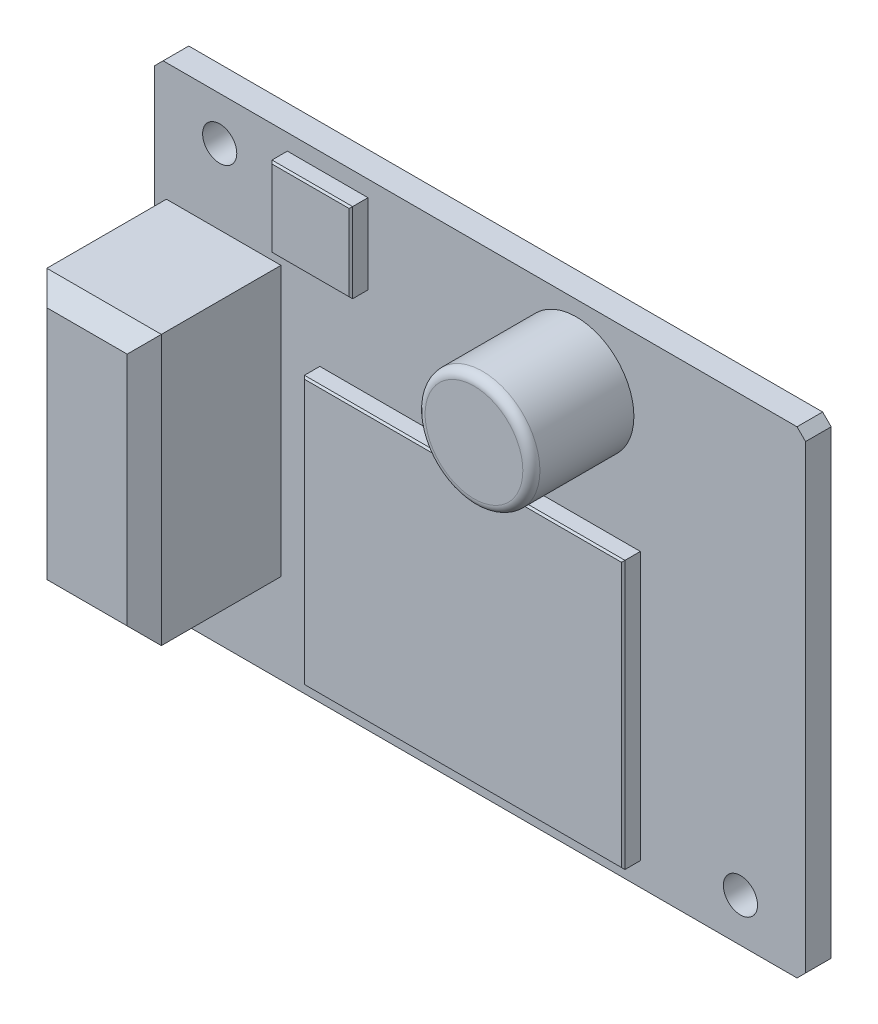
ISO-10303-21;
HEADER;
FILE_DESCRIPTION(('STEP AP214'),'2;1');
FILE_NAME('part.step','',(''),(''),'','','');
FILE_SCHEMA(('AUTOMOTIVE_DESIGN { 1 0 10303 214 1 1 1 1 }'));
ENDSEC;
DATA;
#1=APPLICATION_CONTEXT('core data for automotive mechanical design processes');
#2=APPLICATION_PROTOCOL_DEFINITION('international standard','automotive_design',2000,#1);
#3=PRODUCT_CONTEXT('',#1,'mechanical');
#4=PRODUCT('Part','Part','',(#3));
#5=PRODUCT_RELATED_PRODUCT_CATEGORY('part','',(#4));
#6=PRODUCT_DEFINITION_FORMATION('','',#4);
#7=PRODUCT_DEFINITION_CONTEXT('part definition',#1,'design');
#8=PRODUCT_DEFINITION('design','',#6,#7);
#9=PRODUCT_DEFINITION_SHAPE('','',#8);
#10=(LENGTH_UNIT() NAMED_UNIT(*) SI_UNIT(.MILLI.,.METRE.));
#11=(NAMED_UNIT(*) PLANE_ANGLE_UNIT() SI_UNIT($,.RADIAN.));
#12=(NAMED_UNIT(*) SI_UNIT($,.STERADIAN.) SOLID_ANGLE_UNIT());
#13=UNCERTAINTY_MEASURE_WITH_UNIT(LENGTH_MEASURE(1.E-05),#10,'distance_accuracy_value','');
#14=(GEOMETRIC_REPRESENTATION_CONTEXT(3) GLOBAL_UNCERTAINTY_ASSIGNED_CONTEXT((#13)) GLOBAL_UNIT_ASSIGNED_CONTEXT((#10,
#11,#12)) REPRESENTATION_CONTEXT('',''));
#15=CARTESIAN_POINT('',(0.,0.,0.));
#16=DIRECTION('',(0.,0.,1.));
#17=DIRECTION('',(1.,0.,0.));
#18=AXIS2_PLACEMENT_3D('',#15,#16,#17);
#19=CARTESIAN_POINT('',(0.,0.,1.5));
#20=DIRECTION('',(0.,0.,1.));
#21=DIRECTION('',(1.,0.,0.));
#22=AXIS2_PLACEMENT_3D('',#19,#20,#21);
#23=PLANE('',#22);
#24=CARTESIAN_POINT('',(5.64383642046599,9.72445196188204,1.5));
#25=DIRECTION('',(0.,0.,1.));
#26=DIRECTION('',(1.,0.,0.));
#27=AXIS2_PLACEMENT_3D('',#24,#25,#26);
#28=CIRCLE('',#27,3.35928107864668);
#29=CARTESIAN_POINT('',(9.00311749911266,9.72445196188204,1.5));
#30=VERTEX_POINT('',#29);
#31=EDGE_CURVE('E253',#30,#30,#28,.T.);
#32=ORIENTED_EDGE('',*,*,#31,.F.);
#33=EDGE_LOOP('',(#32));
#34=FACE_BOUND('',#33,.T.);
#35=CARTESIAN_POINT('',(-15.24,11.43,1.5));
#36=DIRECTION('',(0.,0.,1.));
#37=DIRECTION('',(1.,0.,0.));
#38=AXIS2_PLACEMENT_3D('',#35,#36,#37);
#39=CIRCLE('',#38,1.);
#40=CARTESIAN_POINT('',(-14.24,11.43,1.5));
#41=VERTEX_POINT('',#40);
#42=EDGE_CURVE('E323',#41,#41,#39,.T.);
#43=ORIENTED_EDGE('',*,*,#42,.F.);
#44=EDGE_LOOP('',(#43));
#45=FACE_BOUND('',#44,.T.);
#46=DIRECTION('',(1.,0.,0.));
#47=VECTOR('',#46,1.);
#48=CARTESIAN_POINT('',(19.05,-13.97,1.5));
#49=LINE('',#48,#47);
#50=CARTESIAN_POINT('',(-18.55,-13.97,1.5));
#51=VERTEX_POINT('',#50);
#52=CARTESIAN_POINT('',(18.55,-13.97,1.5));
#53=VERTEX_POINT('',#52);
#54=EDGE_CURVE('E335',#51,#53,#49,.T.);
#55=ORIENTED_EDGE('',*,*,#54,.T.);
#56=DIRECTION('',(-0.707106781186552,-0.707106781186543,0.));
#57=VECTOR('',#56,1.);
#58=CARTESIAN_POINT('',(16.2599999999999,-16.2600000000001,1.5));
#59=LINE('',#58,#57);
#60=CARTESIAN_POINT('',(19.05,-13.47,1.5));
#61=VERTEX_POINT('',#60);
#62=EDGE_CURVE('E397',#53,#61,#59,.F.);
#63=ORIENTED_EDGE('',*,*,#62,.T.);
#64=DIRECTION('',(0.,1.,0.));
#65=VECTOR('',#64,1.);
#66=CARTESIAN_POINT('',(19.05,-13.97,1.5));
#67=LINE('',#66,#65);
#68=CARTESIAN_POINT('',(19.05,13.47,1.5));
#69=VERTEX_POINT('',#68);
#70=EDGE_CURVE('E340',#61,#69,#67,.T.);
#71=ORIENTED_EDGE('',*,*,#70,.T.);
#72=DIRECTION('',(0.707106781186548,-0.707106781186548,0.));
#73=VECTOR('',#72,1.);
#74=CARTESIAN_POINT('',(16.26,16.26,1.5));
#75=LINE('',#74,#73);
#76=CARTESIAN_POINT('',(18.55,13.97,1.5));
#77=VERTEX_POINT('',#76);
#78=EDGE_CURVE('E388',#69,#77,#75,.F.);
#79=ORIENTED_EDGE('',*,*,#78,.T.);
#80=DIRECTION('',(-1.,0.,0.));
#81=VECTOR('',#80,1.);
#82=CARTESIAN_POINT('',(19.05,13.97,1.5));
#83=LINE('',#82,#81);
#84=CARTESIAN_POINT('',(-18.55,13.97,1.5));
#85=VERTEX_POINT('',#84);
#86=EDGE_CURVE('E344',#77,#85,#83,.T.);
#87=ORIENTED_EDGE('',*,*,#86,.T.);
#88=DIRECTION('',(0.707106781186552,0.707106781186543,0.));
#89=VECTOR('',#88,1.);
#90=CARTESIAN_POINT('',(-16.2599999999999,16.2600000000001,1.5));
#91=LINE('',#90,#89);
#92=CARTESIAN_POINT('',(-19.05,13.47,1.5));
#93=VERTEX_POINT('',#92);
#94=EDGE_CURVE('E391',#85,#93,#91,.F.);
#95=ORIENTED_EDGE('',*,*,#94,.T.);
#96=DIRECTION('',(0.,-1.,0.));
#97=VECTOR('',#96,1.);
#98=CARTESIAN_POINT('',(-19.05,-13.97,1.5));
#99=LINE('',#98,#97);
#100=CARTESIAN_POINT('',(-19.05,-13.47,1.5));
#101=VERTEX_POINT('',#100);
#102=EDGE_CURVE('E331',#93,#101,#99,.T.);
#103=ORIENTED_EDGE('',*,*,#102,.T.);
#104=DIRECTION('',(-0.707106781186545,0.70710678118655,0.));
#105=VECTOR('',#104,1.);
#106=CARTESIAN_POINT('',(-16.2600000000001,-16.26,1.5));
#107=LINE('',#106,#105);
#108=EDGE_CURVE('E394',#101,#51,#107,.F.);
#109=ORIENTED_EDGE('',*,*,#108,.T.);
#110=EDGE_LOOP('',(#55,#63,#71,#79,#87,#95,#103,#109));
#111=FACE_BOUND('',#110,.T.);
#112=CARTESIAN_POINT('',(15.24,-11.43,1.5));
#113=DIRECTION('',(0.,0.,1.));
#114=DIRECTION('',(1.,0.,0.));
#115=AXIS2_PLACEMENT_3D('',#112,#113,#114);
#116=CIRCLE('',#115,0.999999999999999);
#117=CARTESIAN_POINT('',(16.24,-11.43,1.5));
#118=VERTEX_POINT('',#117);
#119=EDGE_CURVE('E315',#118,#118,#116,.T.);
#120=ORIENTED_EDGE('',*,*,#119,.F.);
#121=EDGE_LOOP('',(#120));
#122=FACE_BOUND('',#121,.T.);
#123=DIRECTION('',(1.,0.,0.));
#124=VECTOR('',#123,1.);
#125=CARTESIAN_POINT('',(9.37932527429958,-12.6072748816884,1.5));
#126=LINE('',#125,#124);
#127=CARTESIAN_POINT('',(-9.37932527429958,-12.6072748816884,1.5));
#128=VERTEX_POINT('',#127);
#129=CARTESIAN_POINT('',(9.37932527429958,-12.6072748816884,1.5));
#130=VERTEX_POINT('',#129);
#131=EDGE_CURVE('E290',#128,#130,#126,.T.);
#132=ORIENTED_EDGE('',*,*,#131,.F.);
#133=DIRECTION('',(0.,-1.,0.));
#134=VECTOR('',#133,1.);
#135=CARTESIAN_POINT('',(-9.37932527429958,-12.6072748816884,1.5));
#136=LINE('',#135,#134);
#137=CARTESIAN_POINT('',(-9.37932527429958,3.0655370485265,1.5));
#138=VERTEX_POINT('',#137);
#139=EDGE_CURVE('E286',#138,#128,#136,.T.);
#140=ORIENTED_EDGE('',*,*,#139,.F.);
#141=DIRECTION('',(-1.,0.,0.));
#142=VECTOR('',#141,1.);
#143=CARTESIAN_POINT('',(9.37932527429958,3.0655370485265,1.5));
#144=LINE('',#143,#142);
#145=CARTESIAN_POINT('',(9.37932527429958,3.0655370485265,1.5));
#146=VERTEX_POINT('',#145);
#147=EDGE_CURVE('E298',#146,#138,#144,.T.);
#148=ORIENTED_EDGE('',*,*,#147,.F.);
#149=DIRECTION('',(0.,1.,0.));
#150=VECTOR('',#149,1.);
#151=CARTESIAN_POINT('',(9.37932527429958,-12.6072748816884,1.5));
#152=LINE('',#151,#150);
#153=EDGE_CURVE('E294',#130,#146,#152,.T.);
#154=ORIENTED_EDGE('',*,*,#153,.F.);
#155=EDGE_LOOP('',(#132,#140,#148,#154));
#156=FACE_BOUND('',#155,.T.);
#157=DIRECTION('',(-1.,0.,0.));
#158=VECTOR('',#157,1.);
#159=CARTESIAN_POINT('',(-11.2790110107537,13.0265293001079,1.5));
#160=LINE('',#159,#158);
#161=CARTESIAN_POINT('',(-6.55931746515758,13.0265293001079,1.5));
#162=VERTEX_POINT('',#161);
#163=CARTESIAN_POINT('',(-11.2790110107537,13.0265293001079,1.5));
#164=VERTEX_POINT('',#163);
#165=EDGE_CURVE('E262',#162,#164,#160,.T.);
#166=ORIENTED_EDGE('',*,*,#165,.F.);
#167=DIRECTION('',(0.,1.,0.));
#168=VECTOR('',#167,1.);
#169=CARTESIAN_POINT('',(-6.55931746515758,13.0265293001079,1.5));
#170=LINE('',#169,#168);
#171=CARTESIAN_POINT('',(-6.55931746515758,8.35246577891262,1.5));
#172=VERTEX_POINT('',#171);
#173=EDGE_CURVE('E257',#172,#162,#170,.T.);
#174=ORIENTED_EDGE('',*,*,#173,.F.);
#175=DIRECTION('',(1.,0.,0.));
#176=VECTOR('',#175,1.);
#177=CARTESIAN_POINT('',(-11.2790110107537,8.35246577891262,1.5));
#178=LINE('',#177,#176);
#179=CARTESIAN_POINT('',(-11.2790110107537,8.35246577891262,1.5));
#180=VERTEX_POINT('',#179);
#181=EDGE_CURVE('E270',#180,#172,#178,.T.);
#182=ORIENTED_EDGE('',*,*,#181,.F.);
#183=DIRECTION('',(0.,-1.,0.));
#184=VECTOR('',#183,1.);
#185=CARTESIAN_POINT('',(-11.2790110107537,13.0265293001079,1.5));
#186=LINE('',#185,#184);
#187=EDGE_CURVE('E266',#164,#180,#186,.T.);
#188=ORIENTED_EDGE('',*,*,#187,.F.);
#189=EDGE_LOOP('',(#166,#174,#182,#188));
#190=FACE_BOUND('',#189,.T.);
#191=DIRECTION('',(-1.,0.,0.));
#192=VECTOR('',#191,1.);
#193=CARTESIAN_POINT('',(-18.3575796964537,7.05089593843697,1.5));
#194=LINE('',#193,#192);
#195=CARTESIAN_POINT('',(-11.6541192100557,7.05089593843697,1.5));
#196=VERTEX_POINT('',#195);
#197=CARTESIAN_POINT('',(-18.3575796964537,7.05089593843697,1.5));
#198=VERTEX_POINT('',#197);
#199=EDGE_CURVE('E218',#196,#198,#194,.T.);
#200=ORIENTED_EDGE('',*,*,#199,.F.);
#201=DIRECTION('',(0.,1.,0.));
#202=VECTOR('',#201,1.);
#203=CARTESIAN_POINT('',(-11.6541192100557,7.05089593843697,1.5));
#204=LINE('',#203,#202);
#205=CARTESIAN_POINT('',(-11.6541192100557,-8.72676106003644,1.5));
#206=VERTEX_POINT('',#205);
#207=EDGE_CURVE('E227',#206,#196,#204,.T.);
#208=ORIENTED_EDGE('',*,*,#207,.F.);
#209=DIRECTION('',(1.,0.,0.));
#210=VECTOR('',#209,1.);
#211=CARTESIAN_POINT('',(-18.3575796964537,-8.72676106003644,1.5));
#212=LINE('',#211,#210);
#213=CARTESIAN_POINT('',(-18.3575796964537,-8.72676106003644,1.5));
#214=VERTEX_POINT('',#213);
#215=EDGE_CURVE('E241',#214,#206,#212,.T.);
#216=ORIENTED_EDGE('',*,*,#215,.F.);
#217=DIRECTION('',(0.,-1.,0.));
#218=VECTOR('',#217,1.);
#219=CARTESIAN_POINT('',(-18.3575796964537,7.05089593843697,1.5));
#220=LINE('',#219,#218);
#221=EDGE_CURVE('E237',#198,#214,#220,.T.);
#222=ORIENTED_EDGE('',*,*,#221,.F.);
#223=EDGE_LOOP('',(#200,#208,#216,#222));
#224=FACE_BOUND('',#223,.T.);
#225=ADVANCED_FACE('F41',(#34,#45,#111,#122,#156,#190,#224),#23,.T.);
#226=CARTESIAN_POINT('',(0.,0.,0.));
#227=DIRECTION('',(0.,0.,1.));
#228=DIRECTION('',(1.,0.,0.));
#229=AXIS2_PLACEMENT_3D('',#226,#227,#228);
#230=PLANE('',#229);
#231=DIRECTION('',(0.,1.,0.));
#232=VECTOR('',#231,1.);
#233=CARTESIAN_POINT('',(19.05,-13.97,0.));
#234=LINE('',#233,#232);
#235=CARTESIAN_POINT('',(19.05,-13.47,0.));
#236=VERTEX_POINT('',#235);
#237=CARTESIAN_POINT('',(19.05,13.47,0.));
#238=VERTEX_POINT('',#237);
#239=EDGE_CURVE('E356',#236,#238,#234,.T.);
#240=ORIENTED_EDGE('',*,*,#239,.F.);
#241=DIRECTION('',(0.707106781186552,0.707106781186543,0.));
#242=VECTOR('',#241,1.);
#243=CARTESIAN_POINT('',(19.05,-13.47,0.));
#244=LINE('',#243,#242);
#245=CARTESIAN_POINT('',(18.55,-13.97,0.));
#246=VERTEX_POINT('',#245);
#247=EDGE_CURVE('E378',#236,#246,#244,.F.);
#248=ORIENTED_EDGE('',*,*,#247,.T.);
#249=DIRECTION('',(1.,0.,0.));
#250=VECTOR('',#249,1.);
#251=CARTESIAN_POINT('',(19.05,-13.97,0.));
#252=LINE('',#251,#250);
#253=CARTESIAN_POINT('',(-18.55,-13.97,0.));
#254=VERTEX_POINT('',#253);
#255=EDGE_CURVE('E352',#254,#246,#252,.T.);
#256=ORIENTED_EDGE('',*,*,#255,.F.);
#257=DIRECTION('',(0.707106781186545,-0.70710678118655,0.));
#258=VECTOR('',#257,1.);
#259=CARTESIAN_POINT('',(-18.55,-13.97,0.));
#260=LINE('',#259,#258);
#261=CARTESIAN_POINT('',(-19.05,-13.47,0.));
#262=VERTEX_POINT('',#261);
#263=EDGE_CURVE('E375',#254,#262,#260,.F.);
#264=ORIENTED_EDGE('',*,*,#263,.T.);
#265=DIRECTION('',(0.,-1.,0.));
#266=VECTOR('',#265,1.);
#267=CARTESIAN_POINT('',(-19.05,-13.97,0.));
#268=LINE('',#267,#266);
#269=CARTESIAN_POINT('',(-19.05,13.47,0.));
#270=VERTEX_POINT('',#269);
#271=EDGE_CURVE('E327',#270,#262,#268,.T.);
#272=ORIENTED_EDGE('',*,*,#271,.F.);
#273=DIRECTION('',(-0.707106781186552,-0.707106781186543,0.));
#274=VECTOR('',#273,1.);
#275=CARTESIAN_POINT('',(-19.05,13.47,0.));
#276=LINE('',#275,#274);
#277=CARTESIAN_POINT('',(-18.55,13.97,0.));
#278=VERTEX_POINT('',#277);
#279=EDGE_CURVE('E372',#270,#278,#276,.F.);
#280=ORIENTED_EDGE('',*,*,#279,.T.);
#281=DIRECTION('',(-1.,0.,0.));
#282=VECTOR('',#281,1.);
#283=CARTESIAN_POINT('',(19.05,13.97,0.));
#284=LINE('',#283,#282);
#285=CARTESIAN_POINT('',(18.55,13.97,0.));
#286=VERTEX_POINT('',#285);
#287=EDGE_CURVE('E336',#286,#278,#284,.T.);
#288=ORIENTED_EDGE('',*,*,#287,.F.);
#289=DIRECTION('',(-0.707106781186548,0.707106781186548,0.));
#290=VECTOR('',#289,1.);
#291=CARTESIAN_POINT('',(18.55,13.97,0.));
#292=LINE('',#291,#290);
#293=EDGE_CURVE('E369',#286,#238,#292,.F.);
#294=ORIENTED_EDGE('',*,*,#293,.T.);
#295=EDGE_LOOP('',(#240,#248,#256,#264,#272,#280,#288,#294));
#296=FACE_BOUND('',#295,.T.);
#297=CARTESIAN_POINT('',(-15.24,11.43,0.));
#298=DIRECTION('',(0.,0.,1.));
#299=DIRECTION('',(1.,0.,0.));
#300=AXIS2_PLACEMENT_3D('',#297,#298,#299);
#301=CIRCLE('',#300,1.);
#302=CARTESIAN_POINT('',(-14.24,11.43,0.));
#303=VERTEX_POINT('',#302);
#304=EDGE_CURVE('E319',#303,#303,#301,.T.);
#305=ORIENTED_EDGE('',*,*,#304,.T.);
#306=EDGE_LOOP('',(#305));
#307=FACE_BOUND('',#306,.T.);
#308=CARTESIAN_POINT('',(15.24,-11.43,0.));
#309=DIRECTION('',(0.,0.,1.));
#310=DIRECTION('',(1.,0.,0.));
#311=AXIS2_PLACEMENT_3D('',#308,#309,#310);
#312=CIRCLE('',#311,0.999999999999999);
#313=CARTESIAN_POINT('',(16.24,-11.43,0.));
#314=VERTEX_POINT('',#313);
#315=EDGE_CURVE('E314',#314,#314,#312,.T.);
#316=ORIENTED_EDGE('',*,*,#315,.T.);
#317=EDGE_LOOP('',(#316));
#318=FACE_BOUND('',#317,.T.);
#319=ADVANCED_FACE('F560',(#296,#307,#318),#230,.F.);
#320=CARTESIAN_POINT('',(-19.05,-13.97,1.5));
#321=DIRECTION('',(1.,0.,0.));
#322=DIRECTION('',(0.,0.,-1.));
#323=AXIS2_PLACEMENT_3D('',#320,#321,#322);
#324=PLANE('',#323);
#325=ORIENTED_EDGE('',*,*,#271,.T.);
#326=DIRECTION('',(0.,0.,1.));
#327=VECTOR('',#326,1.);
#328=CARTESIAN_POINT('',(-19.05,-13.47,1.5));
#329=LINE('',#328,#327);
#330=EDGE_CURVE('E404',#262,#101,#329,.T.);
#331=ORIENTED_EDGE('',*,*,#330,.T.);
#332=ORIENTED_EDGE('',*,*,#102,.F.);
#333=DIRECTION('',(0.,0.,-1.));
#334=VECTOR('',#333,1.);
#335=CARTESIAN_POINT('',(-19.05,13.47,1.5));
#336=LINE('',#335,#334);
#337=EDGE_CURVE('E400',#93,#270,#336,.T.);
#338=ORIENTED_EDGE('',*,*,#337,.T.);
#339=EDGE_LOOP('',(#325,#331,#332,#338));
#340=FACE_BOUND('',#339,.T.);
#341=ADVANCED_FACE('F566',(#340),#324,.F.);
#342=CARTESIAN_POINT('',(19.05,-13.97,1.5));
#343=DIRECTION('',(0.,1.,0.));
#344=DIRECTION('',(-1.,0.,0.));
#345=AXIS2_PLACEMENT_3D('',#342,#343,#344);
#346=PLANE('',#345);
#347=ORIENTED_EDGE('',*,*,#255,.T.);
#348=DIRECTION('',(0.,0.,1.));
#349=VECTOR('',#348,1.);
#350=CARTESIAN_POINT('',(18.55,-13.97,1.5));
#351=LINE('',#350,#349);
#352=EDGE_CURVE('E385',#246,#53,#351,.T.);
#353=ORIENTED_EDGE('',*,*,#352,.T.);
#354=ORIENTED_EDGE('',*,*,#54,.F.);
#355=DIRECTION('',(0.,0.,-1.));
#356=VECTOR('',#355,1.);
#357=CARTESIAN_POINT('',(-18.55,-13.97,1.5));
#358=LINE('',#357,#356);
#359=EDGE_CURVE('E381',#51,#254,#358,.T.);
#360=ORIENTED_EDGE('',*,*,#359,.T.);
#361=EDGE_LOOP('',(#347,#353,#354,#360));
#362=FACE_BOUND('',#361,.T.);
#363=ADVANCED_FACE('F582',(#362),#346,.F.);
#364=CARTESIAN_POINT('',(19.05,-13.97,1.5));
#365=DIRECTION('',(-1.,0.,0.));
#366=DIRECTION('',(0.,-1.,0.));
#367=AXIS2_PLACEMENT_3D('',#364,#365,#366);
#368=PLANE('',#367);
#369=ORIENTED_EDGE('',*,*,#70,.F.);
#370=DIRECTION('',(0.,0.,-1.));
#371=VECTOR('',#370,1.);
#372=CARTESIAN_POINT('',(19.05,-13.47,1.5));
#373=LINE('',#372,#371);
#374=EDGE_CURVE('E365',#61,#236,#373,.T.);
#375=ORIENTED_EDGE('',*,*,#374,.T.);
#376=ORIENTED_EDGE('',*,*,#239,.T.);
#377=DIRECTION('',(0.,0.,1.));
#378=VECTOR('',#377,1.);
#379=CARTESIAN_POINT('',(19.05,13.47,1.5));
#380=LINE('',#379,#378);
#381=EDGE_CURVE('E348',#238,#69,#380,.T.);
#382=ORIENTED_EDGE('',*,*,#381,.T.);
#383=EDGE_LOOP('',(#369,#375,#376,#382));
#384=FACE_BOUND('',#383,.T.);
#385=ADVANCED_FACE('F578',(#384),#368,.F.);
#386=CARTESIAN_POINT('',(19.05,13.97,1.5));
#387=DIRECTION('',(0.,-1.,0.));
#388=DIRECTION('',(1.,0.,0.));
#389=AXIS2_PLACEMENT_3D('',#386,#387,#388);
#390=PLANE('',#389);
#391=ORIENTED_EDGE('',*,*,#287,.T.);
#392=DIRECTION('',(0.,0.,1.));
#393=VECTOR('',#392,1.);
#394=CARTESIAN_POINT('',(-18.55,13.97,1.5));
#395=LINE('',#394,#393);
#396=EDGE_CURVE('E411',#278,#85,#395,.T.);
#397=ORIENTED_EDGE('',*,*,#396,.T.);
#398=ORIENTED_EDGE('',*,*,#86,.F.);
#399=DIRECTION('',(0.,0.,-1.));
#400=VECTOR('',#399,1.);
#401=CARTESIAN_POINT('',(18.55,13.97,1.5));
#402=LINE('',#401,#400);
#403=EDGE_CURVE('E407',#77,#286,#402,.T.);
#404=ORIENTED_EDGE('',*,*,#403,.T.);
#405=EDGE_LOOP('',(#391,#397,#398,#404));
#406=FACE_BOUND('',#405,.T.);
#407=ADVANCED_FACE('F575',(#406),#390,.F.);
#408=CARTESIAN_POINT('',(-15.24,11.43,1.5));
#409=DIRECTION('',(0.,0.,-1.));
#410=DIRECTION('',(-1.,0.,0.));
#411=AXIS2_PLACEMENT_3D('',#408,#409,#410);
#412=CYLINDRICAL_SURFACE('',#411,1.);
#413=ORIENTED_EDGE('',*,*,#42,.T.);
#414=EDGE_LOOP('',(#413));
#415=FACE_BOUND('',#414,.T.);
#416=ORIENTED_EDGE('',*,*,#304,.F.);
#417=EDGE_LOOP('',(#416));
#418=FACE_BOUND('',#417,.T.);
#419=ADVANCED_FACE('F572',(#415,#418),#412,.F.);
#420=CARTESIAN_POINT('',(15.24,-11.43,1.5));
#421=DIRECTION('',(0.,0.,-1.));
#422=DIRECTION('',(-1.,0.,0.));
#423=AXIS2_PLACEMENT_3D('',#420,#421,#422);
#424=CYLINDRICAL_SURFACE('',#423,0.999999999999999);
#425=ORIENTED_EDGE('',*,*,#119,.T.);
#426=EDGE_LOOP('',(#425));
#427=FACE_BOUND('',#426,.T.);
#428=ORIENTED_EDGE('',*,*,#315,.F.);
#429=EDGE_LOOP('',(#428));
#430=FACE_BOUND('',#429,.T.);
#431=ADVANCED_FACE('F594',(#427,#430),#424,.F.);
#432=CARTESIAN_POINT('',(19.05,-13.47,1.5));
#433=DIRECTION('',(-0.707106781186542,0.707106781186552,0.));
#434=DIRECTION('',(0.,0.,-1.));
#435=AXIS2_PLACEMENT_3D('',#432,#433,#434);
#436=PLANE('',#435);
#437=ORIENTED_EDGE('',*,*,#62,.F.);
#438=ORIENTED_EDGE('',*,*,#352,.F.);
#439=ORIENTED_EDGE('',*,*,#247,.F.);
#440=ORIENTED_EDGE('',*,*,#374,.F.);
#441=EDGE_LOOP('',(#437,#438,#439,#440));
#442=FACE_BOUND('',#441,.T.);
#443=ADVANCED_FACE('F590',(#442),#436,.F.);
#444=CARTESIAN_POINT('',(-18.55,-13.97,1.5));
#445=DIRECTION('',(0.70710678118655,0.707106781186545,0.));
#446=DIRECTION('',(0.,0.,-1.));
#447=AXIS2_PLACEMENT_3D('',#444,#445,#446);
#448=PLANE('',#447);
#449=ORIENTED_EDGE('',*,*,#108,.F.);
#450=ORIENTED_EDGE('',*,*,#330,.F.);
#451=ORIENTED_EDGE('',*,*,#263,.F.);
#452=ORIENTED_EDGE('',*,*,#359,.F.);
#453=EDGE_LOOP('',(#449,#450,#451,#452));
#454=FACE_BOUND('',#453,.T.);
#455=ADVANCED_FACE('F593',(#454),#448,.F.);
#456=CARTESIAN_POINT('',(-19.05,13.47,1.5));
#457=DIRECTION('',(0.707106781186542,-0.707106781186552,0.));
#458=DIRECTION('',(0.,0.,-1.));
#459=AXIS2_PLACEMENT_3D('',#456,#457,#458);
#460=PLANE('',#459);
#461=ORIENTED_EDGE('',*,*,#94,.F.);
#462=ORIENTED_EDGE('',*,*,#396,.F.);
#463=ORIENTED_EDGE('',*,*,#279,.F.);
#464=ORIENTED_EDGE('',*,*,#337,.F.);
#465=EDGE_LOOP('',(#461,#462,#463,#464));
#466=FACE_BOUND('',#465,.T.);
#467=ADVANCED_FACE('F598',(#466),#460,.F.);
#468=CARTESIAN_POINT('',(18.55,13.97,1.5));
#469=DIRECTION('',(-0.707106781186547,-0.707106781186547,0.));
#470=DIRECTION('',(0.,0.,-1.));
#471=AXIS2_PLACEMENT_3D('',#468,#469,#470);
#472=PLANE('',#471);
#473=ORIENTED_EDGE('',*,*,#78,.F.);
#474=ORIENTED_EDGE('',*,*,#381,.F.);
#475=ORIENTED_EDGE('',*,*,#293,.F.);
#476=ORIENTED_EDGE('',*,*,#403,.F.);
#477=EDGE_LOOP('',(#473,#474,#475,#476));
#478=FACE_BOUND('',#477,.T.);
#479=ADVANCED_FACE('F602',(#478),#472,.F.);
#480=CARTESIAN_POINT('',(-9.37932527429958,-12.6072748816884,2.5));
#481=DIRECTION('',(1.,0.,0.));
#482=DIRECTION('',(0.,0.,-1.));
#483=AXIS2_PLACEMENT_3D('',#480,#481,#482);
#484=PLANE('',#483);
#485=DIRECTION('',(0.,0.,-1.));
#486=VECTOR('',#485,1.);
#487=CARTESIAN_POINT('',(-9.37932527429958,-12.6072748816884,2.5));
#488=LINE('',#487,#486);
#489=CARTESIAN_POINT('',(-9.37932527429958,-12.6072748816884,2.4));
#490=VERTEX_POINT('',#489);
#491=EDGE_CURVE('E311',#490,#128,#488,.T.);
#492=ORIENTED_EDGE('',*,*,#491,.F.);
#493=DIRECTION('',(0.,1.,0.));
#494=VECTOR('',#493,1.);
#495=CARTESIAN_POINT('',(-9.37932527429958,3.0655370485265,2.4));
#496=LINE('',#495,#494);
#497=CARTESIAN_POINT('',(-9.37932527429958,3.0655370485265,2.4));
#498=VERTEX_POINT('',#497);
#499=EDGE_CURVE('E437',#490,#498,#496,.T.);
#500=ORIENTED_EDGE('',*,*,#499,.T.);
#501=DIRECTION('',(0.,0.,-1.));
#502=VECTOR('',#501,1.);
#503=CARTESIAN_POINT('',(-9.37932527429958,3.0655370485265,2.5));
#504=LINE('',#503,#502);
#505=EDGE_CURVE('E302',#498,#138,#504,.T.);
#506=ORIENTED_EDGE('',*,*,#505,.T.);
#507=ORIENTED_EDGE('',*,*,#139,.T.);
#508=EDGE_LOOP('',(#492,#500,#506,#507));
#509=FACE_BOUND('',#508,.T.);
#510=ADVANCED_FACE('F606',(#509),#484,.F.);
#511=CARTESIAN_POINT('',(9.37932527429958,-12.6072748816884,2.5));
#512=DIRECTION('',(0.,1.,0.));
#513=DIRECTION('',(0.,0.,1.));
#514=AXIS2_PLACEMENT_3D('',#511,#512,#513);
#515=PLANE('',#514);
#516=DIRECTION('',(0.,0.,-1.));
#517=VECTOR('',#516,1.);
#518=CARTESIAN_POINT('',(9.37932527429958,-12.6072748816884,2.5));
#519=LINE('',#518,#517);
#520=CARTESIAN_POINT('',(9.37932527429958,-12.6072748816884,2.4));
#521=VERTEX_POINT('',#520);
#522=EDGE_CURVE('E308',#521,#130,#519,.T.);
#523=ORIENTED_EDGE('',*,*,#522,.F.);
#524=DIRECTION('',(-1.,0.,0.));
#525=VECTOR('',#524,1.);
#526=CARTESIAN_POINT('',(-9.37932527429958,-12.6072748816884,2.4));
#527=LINE('',#526,#525);
#528=EDGE_CURVE('E434',#521,#490,#527,.T.);
#529=ORIENTED_EDGE('',*,*,#528,.T.);
#530=ORIENTED_EDGE('',*,*,#491,.T.);
#531=ORIENTED_EDGE('',*,*,#131,.T.);
#532=EDGE_LOOP('',(#523,#529,#530,#531));
#533=FACE_BOUND('',#532,.T.);
#534=ADVANCED_FACE('F889',(#533),#515,.F.);
#535=CARTESIAN_POINT('',(9.37932527429958,-12.6072748816884,2.5));
#536=DIRECTION('',(-1.,0.,0.));
#537=DIRECTION('',(0.,0.,1.));
#538=AXIS2_PLACEMENT_3D('',#535,#536,#537);
#539=PLANE('',#538);
#540=DIRECTION('',(0.,0.,-1.));
#541=VECTOR('',#540,1.);
#542=CARTESIAN_POINT('',(9.37932527429958,3.0655370485265,2.5));
#543=LINE('',#542,#541);
#544=CARTESIAN_POINT('',(9.37932527429958,3.0655370485265,2.4));
#545=VERTEX_POINT('',#544);
#546=EDGE_CURVE('E305',#545,#146,#543,.T.);
#547=ORIENTED_EDGE('',*,*,#546,.F.);
#548=DIRECTION('',(0.,-1.,0.));
#549=VECTOR('',#548,1.);
#550=CARTESIAN_POINT('',(9.37932527429958,-12.6072748816884,2.4));
#551=LINE('',#550,#549);
#552=EDGE_CURVE('E431',#545,#521,#551,.T.);
#553=ORIENTED_EDGE('',*,*,#552,.T.);
#554=ORIENTED_EDGE('',*,*,#522,.T.);
#555=ORIENTED_EDGE('',*,*,#153,.T.);
#556=EDGE_LOOP('',(#547,#553,#554,#555));
#557=FACE_BOUND('',#556,.T.);
#558=ADVANCED_FACE('F878',(#557),#539,.F.);
#559=CARTESIAN_POINT('',(9.37932527429958,3.0655370485265,2.5));
#560=DIRECTION('',(0.,-1.,0.));
#561=DIRECTION('',(0.,0.,-1.));
#562=AXIS2_PLACEMENT_3D('',#559,#560,#561);
#563=PLANE('',#562);
#564=ORIENTED_EDGE('',*,*,#505,.F.);
#565=DIRECTION('',(1.,0.,0.));
#566=VECTOR('',#565,1.);
#567=CARTESIAN_POINT('',(9.37932527429958,3.0655370485265,2.4));
#568=LINE('',#567,#566);
#569=EDGE_CURVE('E427',#498,#545,#568,.T.);
#570=ORIENTED_EDGE('',*,*,#569,.T.);
#571=ORIENTED_EDGE('',*,*,#546,.T.);
#572=ORIENTED_EDGE('',*,*,#147,.T.);
#573=EDGE_LOOP('',(#564,#570,#571,#572));
#574=FACE_BOUND('',#573,.T.);
#575=ADVANCED_FACE('F867',(#574),#563,.F.);
#576=CARTESIAN_POINT('',(0.,0.,2.5));
#577=DIRECTION('',(0.,0.,1.));
#578=DIRECTION('',(1.,0.,0.));
#579=AXIS2_PLACEMENT_3D('',#576,#577,#578);
#580=PLANE('',#579);
#581=DIRECTION('',(0.,1.,0.));
#582=VECTOR('',#581,1.);
#583=CARTESIAN_POINT('',(9.27932527429958,3.0655370485265,2.5));
#584=LINE('',#583,#582);
#585=CARTESIAN_POINT('',(9.27932527429958,-12.5072748816884,2.5));
#586=VERTEX_POINT('',#585);
#587=CARTESIAN_POINT('',(9.27932527429958,2.96553704852649,2.5));
#588=VERTEX_POINT('',#587);
#589=EDGE_CURVE('E420',#586,#588,#584,.T.);
#590=ORIENTED_EDGE('',*,*,#589,.T.);
#591=DIRECTION('',(-1.,0.,0.));
#592=VECTOR('',#591,1.);
#593=CARTESIAN_POINT('',(-9.37932527429958,2.96553704852649,2.5));
#594=LINE('',#593,#592);
#595=CARTESIAN_POINT('',(-9.27932527429958,2.96553704852649,2.5));
#596=VERTEX_POINT('',#595);
#597=EDGE_CURVE('E423',#588,#596,#594,.T.);
#598=ORIENTED_EDGE('',*,*,#597,.T.);
#599=DIRECTION('',(0.,-1.,0.));
#600=VECTOR('',#599,1.);
#601=CARTESIAN_POINT('',(-9.27932527429958,-12.6072748816884,2.5));
#602=LINE('',#601,#600);
#603=CARTESIAN_POINT('',(-9.27932527429958,-12.5072748816884,2.5));
#604=VERTEX_POINT('',#603);
#605=EDGE_CURVE('E414',#596,#604,#602,.T.);
#606=ORIENTED_EDGE('',*,*,#605,.T.);
#607=DIRECTION('',(1.,0.,0.));
#608=VECTOR('',#607,1.);
#609=CARTESIAN_POINT('',(9.37932527429958,-12.5072748816884,2.5));
#610=LINE('',#609,#608);
#611=EDGE_CURVE('E417',#604,#586,#610,.T.);
#612=ORIENTED_EDGE('',*,*,#611,.T.);
#613=EDGE_LOOP('',(#590,#598,#606,#612));
#614=FACE_BOUND('',#613,.T.);
#615=ADVANCED_FACE('F857',(#614),#580,.T.);
#616=CARTESIAN_POINT('',(-6.55931746515758,13.0265293001079,2.5));
#617=DIRECTION('',(-1.,0.,0.));
#618=DIRECTION('',(0.,0.,1.));
#619=AXIS2_PLACEMENT_3D('',#616,#617,#618);
#620=PLANE('',#619);
#621=DIRECTION('',(0.,0.,-1.));
#622=VECTOR('',#621,1.);
#623=CARTESIAN_POINT('',(-6.55931746515758,13.0265293001079,2.5));
#624=LINE('',#623,#622);
#625=CARTESIAN_POINT('',(-6.55931746515758,13.0265293001079,2.4));
#626=VERTEX_POINT('',#625);
#627=EDGE_CURVE('E283',#626,#162,#624,.T.);
#628=ORIENTED_EDGE('',*,*,#627,.F.);
#629=DIRECTION('',(0.,-1.,0.));
#630=VECTOR('',#629,1.);
#631=CARTESIAN_POINT('',(-6.55931746515758,8.35246577891262,2.4));
#632=LINE('',#631,#630);
#633=CARTESIAN_POINT('',(-6.55931746515758,8.35246577891262,2.4));
#634=VERTEX_POINT('',#633);
#635=EDGE_CURVE('E463',#626,#634,#632,.T.);
#636=ORIENTED_EDGE('',*,*,#635,.T.);
#637=DIRECTION('',(0.,0.,-1.));
#638=VECTOR('',#637,1.);
#639=CARTESIAN_POINT('',(-6.55931746515758,8.35246577891262,2.5));
#640=LINE('',#639,#638);
#641=EDGE_CURVE('E274',#634,#172,#640,.T.);
#642=ORIENTED_EDGE('',*,*,#641,.T.);
#643=ORIENTED_EDGE('',*,*,#173,.T.);
#644=EDGE_LOOP('',(#628,#636,#642,#643));
#645=FACE_BOUND('',#644,.T.);
#646=ADVANCED_FACE('F847',(#645),#620,.F.);
#647=CARTESIAN_POINT('',(-11.2790110107537,13.0265293001079,2.5));
#648=DIRECTION('',(0.,-1.,0.));
#649=DIRECTION('',(0.,0.,-1.));
#650=AXIS2_PLACEMENT_3D('',#647,#648,#649);
#651=PLANE('',#650);
#652=DIRECTION('',(0.,0.,-1.));
#653=VECTOR('',#652,1.);
#654=CARTESIAN_POINT('',(-11.2790110107537,13.0265293001079,2.5));
#655=LINE('',#654,#653);
#656=CARTESIAN_POINT('',(-11.2790110107537,13.0265293001079,2.4));
#657=VERTEX_POINT('',#656);
#658=EDGE_CURVE('E280',#657,#164,#655,.T.);
#659=ORIENTED_EDGE('',*,*,#658,.F.);
#660=DIRECTION('',(1.,0.,0.));
#661=VECTOR('',#660,1.);
#662=CARTESIAN_POINT('',(-6.55931746515758,13.0265293001079,2.4));
#663=LINE('',#662,#661);
#664=EDGE_CURVE('E460',#657,#626,#663,.T.);
#665=ORIENTED_EDGE('',*,*,#664,.T.);
#666=ORIENTED_EDGE('',*,*,#627,.T.);
#667=ORIENTED_EDGE('',*,*,#165,.T.);
#668=EDGE_LOOP('',(#659,#665,#666,#667));
#669=FACE_BOUND('',#668,.T.);
#670=ADVANCED_FACE('F836',(#669),#651,.F.);
#671=CARTESIAN_POINT('',(-11.2790110107537,13.0265293001079,2.5));
#672=DIRECTION('',(1.,0.,0.));
#673=DIRECTION('',(0.,0.,-1.));
#674=AXIS2_PLACEMENT_3D('',#671,#672,#673);
#675=PLANE('',#674);
#676=DIRECTION('',(0.,0.,-1.));
#677=VECTOR('',#676,1.);
#678=CARTESIAN_POINT('',(-11.2790110107537,8.35246577891262,2.5));
#679=LINE('',#678,#677);
#680=CARTESIAN_POINT('',(-11.2790110107537,8.35246577891262,2.4));
#681=VERTEX_POINT('',#680);
#682=EDGE_CURVE('E277',#681,#180,#679,.T.);
#683=ORIENTED_EDGE('',*,*,#682,.F.);
#684=DIRECTION('',(0.,1.,0.));
#685=VECTOR('',#684,1.);
#686=CARTESIAN_POINT('',(-11.2790110107537,13.0265293001079,2.4));
#687=LINE('',#686,#685);
#688=EDGE_CURVE('E457',#681,#657,#687,.T.);
#689=ORIENTED_EDGE('',*,*,#688,.T.);
#690=ORIENTED_EDGE('',*,*,#658,.T.);
#691=ORIENTED_EDGE('',*,*,#187,.T.);
#692=EDGE_LOOP('',(#683,#689,#690,#691));
#693=FACE_BOUND('',#692,.T.);
#694=ADVANCED_FACE('F825',(#693),#675,.F.);
#695=CARTESIAN_POINT('',(-11.2790110107537,8.35246577891262,2.5));
#696=DIRECTION('',(0.,1.,0.));
#697=DIRECTION('',(0.,0.,1.));
#698=AXIS2_PLACEMENT_3D('',#695,#696,#697);
#699=PLANE('',#698);
#700=ORIENTED_EDGE('',*,*,#641,.F.);
#701=DIRECTION('',(-1.,0.,0.));
#702=VECTOR('',#701,1.);
#703=CARTESIAN_POINT('',(-11.2790110107537,8.35246577891262,2.4));
#704=LINE('',#703,#702);
#705=EDGE_CURVE('E453',#634,#681,#704,.T.);
#706=ORIENTED_EDGE('',*,*,#705,.T.);
#707=ORIENTED_EDGE('',*,*,#682,.T.);
#708=ORIENTED_EDGE('',*,*,#181,.T.);
#709=EDGE_LOOP('',(#700,#706,#707,#708));
#710=FACE_BOUND('',#709,.T.);
#711=ADVANCED_FACE('F813',(#710),#699,.F.);
#712=CARTESIAN_POINT('',(0.,0.,2.5));
#713=DIRECTION('',(0.,0.,1.));
#714=DIRECTION('',(1.,0.,0.));
#715=AXIS2_PLACEMENT_3D('',#712,#713,#714);
#716=PLANE('',#715);
#717=DIRECTION('',(0.,-1.,0.));
#718=VECTOR('',#717,1.);
#719=CARTESIAN_POINT('',(-11.1790110107537,8.35246577891262,2.5));
#720=LINE('',#719,#718);
#721=CARTESIAN_POINT('',(-11.1790110107537,12.9265293001079,2.5));
#722=VERTEX_POINT('',#721);
#723=CARTESIAN_POINT('',(-11.1790110107537,8.45246577891262,2.5));
#724=VERTEX_POINT('',#723);
#725=EDGE_CURVE('E446',#722,#724,#720,.T.);
#726=ORIENTED_EDGE('',*,*,#725,.T.);
#727=DIRECTION('',(1.,0.,0.));
#728=VECTOR('',#727,1.);
#729=CARTESIAN_POINT('',(-6.55931746515758,8.45246577891262,2.5));
#730=LINE('',#729,#728);
#731=CARTESIAN_POINT('',(-6.65931746515758,8.45246577891262,2.5));
#732=VERTEX_POINT('',#731);
#733=EDGE_CURVE('E449',#724,#732,#730,.T.);
#734=ORIENTED_EDGE('',*,*,#733,.T.);
#735=DIRECTION('',(0.,1.,0.));
#736=VECTOR('',#735,1.);
#737=CARTESIAN_POINT('',(-6.65931746515758,13.0265293001079,2.5));
#738=LINE('',#737,#736);
#739=CARTESIAN_POINT('',(-6.65931746515758,12.9265293001079,2.5));
#740=VERTEX_POINT('',#739);
#741=EDGE_CURVE('E440',#732,#740,#738,.T.);
#742=ORIENTED_EDGE('',*,*,#741,.T.);
#743=DIRECTION('',(-1.,0.,0.));
#744=VECTOR('',#743,1.);
#745=CARTESIAN_POINT('',(-11.2790110107537,12.9265293001079,2.5));
#746=LINE('',#745,#744);
#747=EDGE_CURVE('E443',#740,#722,#746,.T.);
#748=ORIENTED_EDGE('',*,*,#747,.T.);
#749=EDGE_LOOP('',(#726,#734,#742,#748));
#750=FACE_BOUND('',#749,.T.);
#751=ADVANCED_FACE('F747',(#750),#716,.T.);
#752=CARTESIAN_POINT('',(5.64383642046599,9.72445196188204,7.5));
#753=DIRECTION('',(0.,0.,-1.));
#754=DIRECTION('',(-1.,0.,0.));
#755=AXIS2_PLACEMENT_3D('',#752,#753,#754);
#756=CYLINDRICAL_SURFACE('',#755,3.35928107864668);
#757=CARTESIAN_POINT('',(5.64383642046599,9.72445196188204,7.));
#758=DIRECTION('',(0.,0.,1.));
#759=DIRECTION('',(1.,0.,0.));
#760=AXIS2_PLACEMENT_3D('',#757,#758,#759);
#761=CIRCLE('',#760,3.35928107864668);
#762=CARTESIAN_POINT('',(9.00311749911266,9.72445196188204,7.));
#763=VERTEX_POINT('',#762);
#764=EDGE_CURVE('E496',#763,#763,#761,.F.);
#765=ORIENTED_EDGE('',*,*,#764,.T.);
#766=EDGE_LOOP('',(#765));
#767=FACE_BOUND('',#766,.T.);
#768=ORIENTED_EDGE('',*,*,#31,.T.);
#769=EDGE_LOOP('',(#768));
#770=FACE_BOUND('',#769,.T.);
#771=ADVANCED_FACE('F735',(#767,#770),#756,.T.);
#772=CARTESIAN_POINT('',(5.64383642046599,9.72445196188204,7.5));
#773=DIRECTION('',(0.,0.,1.));
#774=DIRECTION('',(1.,0.,0.));
#775=AXIS2_PLACEMENT_3D('',#772,#773,#774);
#776=PLANE('',#775);
#777=CARTESIAN_POINT('',(5.64383642046599,9.72445196188204,7.5));
#778=DIRECTION('',(0.,0.,1.));
#779=DIRECTION('',(1.,0.,0.));
#780=AXIS2_PLACEMENT_3D('',#777,#778,#779);
#781=CIRCLE('',#780,2.85928107864668);
#782=CARTESIAN_POINT('',(8.50311749911266,9.72445196188204,7.5));
#783=VERTEX_POINT('',#782);
#784=EDGE_CURVE('E466',#783,#783,#781,.T.);
#785=ORIENTED_EDGE('',*,*,#784,.T.);
#786=EDGE_LOOP('',(#785));
#787=FACE_BOUND('',#786,.T.);
#788=ADVANCED_FACE('F624',(#787),#776,.T.);
#789=CARTESIAN_POINT('',(0.,-12.5072748816884,2.5));
#790=DIRECTION('',(0.,-0.707106781186548,0.707106781186548));
#791=DIRECTION('',(-1.,0.,0.));
#792=AXIS2_PLACEMENT_3D('',#789,#790,#791);
#793=PLANE('',#792);
#794=DIRECTION('',(0.577350269189626,0.577350269189626,0.577350269189626));
#795=VECTOR('',#794,1.);
#796=CARTESIAN_POINT('',(-5.11023364707012,-8.33818325445893,6.66909162722946));
#797=LINE('',#796,#795);
#798=EDGE_CURVE('E474',#490,#604,#797,.T.);
#799=ORIENTED_EDGE('',*,*,#798,.F.);
#800=ORIENTED_EDGE('',*,*,#528,.F.);
#801=DIRECTION('',(-0.577350269189626,0.577350269189626,0.577350269189626));
#802=VECTOR('',#801,1.);
#803=CARTESIAN_POINT('',(6.18621684953305,-9.41416645692186,5.59310842476653));
#804=LINE('',#803,#802);
#805=EDGE_CURVE('E258',#586,#521,#804,.F.);
#806=ORIENTED_EDGE('',*,*,#805,.F.);
#807=ORIENTED_EDGE('',*,*,#611,.F.);
#808=EDGE_LOOP('',(#799,#800,#806,#807));
#809=FACE_BOUND('',#808,.T.);
#810=ADVANCED_FACE('F620',(#809),#793,.T.);
#811=CARTESIAN_POINT('',(9.27932527429958,0.,2.5));
#812=DIRECTION('',(0.707106781186548,0.,0.707106781186548));
#813=DIRECTION('',(0.,-1.,0.));
#814=AXIS2_PLACEMENT_3D('',#811,#812,#813);
#815=PLANE('',#814);
#816=ORIENTED_EDGE('',*,*,#805,.T.);
#817=ORIENTED_EDGE('',*,*,#552,.F.);
#818=DIRECTION('',(-0.577350269189626,-0.577350269189626,0.577350269189626));
#819=VECTOR('',#818,1.);
#820=CARTESIAN_POINT('',(8.29081292479075,1.97702469901766,3.48851234950883));
#821=LINE('',#820,#819);
#822=EDGE_CURVE('E470',#588,#545,#821,.F.);
#823=ORIENTED_EDGE('',*,*,#822,.F.);
#824=ORIENTED_EDGE('',*,*,#589,.F.);
#825=EDGE_LOOP('',(#816,#817,#823,#824));
#826=FACE_BOUND('',#825,.T.);
#827=ADVANCED_FACE('F616',(#826),#815,.T.);
#828=CARTESIAN_POINT('',(-9.27932527429958,0.,2.5));
#829=DIRECTION('',(-0.707106781186548,0.,0.707106781186548));
#830=DIRECTION('',(0.,1.,0.));
#831=AXIS2_PLACEMENT_3D('',#828,#829,#830);
#832=PLANE('',#831);
#833=ORIENTED_EDGE('',*,*,#798,.T.);
#834=ORIENTED_EDGE('',*,*,#605,.F.);
#835=DIRECTION('',(-0.577350269189626,0.577350269189626,-0.577350269189626));
#836=VECTOR('',#835,1.);
#837=CARTESIAN_POINT('',(-8.29081292479075,1.97702469901766,3.48851234950883));
#838=LINE('',#837,#836);
#839=EDGE_CURVE('E467',#498,#596,#838,.F.);
#840=ORIENTED_EDGE('',*,*,#839,.F.);
#841=ORIENTED_EDGE('',*,*,#499,.F.);
#842=EDGE_LOOP('',(#833,#834,#840,#841));
#843=FACE_BOUND('',#842,.T.);
#844=ADVANCED_FACE('F612',(#843),#832,.T.);
#845=CARTESIAN_POINT('',(0.,2.96553704852649,2.5));
#846=DIRECTION('',(0.,0.707106781186548,0.707106781186548));
#847=DIRECTION('',(1.,0.,0.));
#848=AXIS2_PLACEMENT_3D('',#845,#846,#847);
#849=PLANE('',#848);
#850=ORIENTED_EDGE('',*,*,#822,.T.);
#851=ORIENTED_EDGE('',*,*,#569,.F.);
#852=ORIENTED_EDGE('',*,*,#839,.T.);
#853=ORIENTED_EDGE('',*,*,#597,.F.);
#854=EDGE_LOOP('',(#850,#851,#852,#853));
#855=FACE_BOUND('',#854,.T.);
#856=ADVANCED_FACE('F608',(#855),#849,.T.);
#857=CARTESIAN_POINT('',(0.,12.9265293001079,2.5));
#858=DIRECTION('',(0.,0.707106781186548,0.707106781186548));
#859=DIRECTION('',(1.,0.,0.));
#860=AXIS2_PLACEMENT_3D('',#857,#858,#859);
#861=PLANE('',#860);
#862=DIRECTION('',(-0.577350269189626,-0.577350269189626,0.577350269189626));
#863=VECTOR('',#862,1.);
#864=CARTESIAN_POINT('',(-10.9681605651935,8.61768620007193,6.80884310003596));
#865=LINE('',#864,#863);
#866=EDGE_CURVE('E486',#626,#740,#865,.T.);
#867=ORIENTED_EDGE('',*,*,#866,.F.);
#868=ORIENTED_EDGE('',*,*,#664,.F.);
#869=DIRECTION('',(0.577350269189626,-0.577350269189626,0.577350269189626));
#870=VECTOR('',#869,1.);
#871=CARTESIAN_POINT('',(-7.45267400716911,9.20019229652335,6.22633700358455));
#872=LINE('',#871,#870);
#873=EDGE_CURVE('E471',#722,#657,#872,.F.);
#874=ORIENTED_EDGE('',*,*,#873,.F.);
#875=ORIENTED_EDGE('',*,*,#747,.F.);
#876=EDGE_LOOP('',(#867,#868,#874,#875));
#877=FACE_BOUND('',#876,.T.);
#878=ADVANCED_FACE('F611',(#877),#861,.T.);
#879=CARTESIAN_POINT('',(-11.1790110107537,0.,2.5));
#880=DIRECTION('',(-0.707106781186548,0.,0.707106781186548));
#881=DIRECTION('',(0.,1.,0.));
#882=AXIS2_PLACEMENT_3D('',#879,#880,#881);
#883=PLANE('',#882);
#884=ORIENTED_EDGE('',*,*,#873,.T.);
#885=ORIENTED_EDGE('',*,*,#688,.F.);
#886=DIRECTION('',(0.577350269189626,0.577350269189626,0.577350269189626));
#887=VECTOR('',#886,1.);
#888=CARTESIAN_POINT('',(-13.9964996037245,5.63497718594175,-0.317488592970874));
#889=LINE('',#888,#887);
#890=EDGE_CURVE('E483',#724,#681,#889,.F.);
#891=ORIENTED_EDGE('',*,*,#890,.F.);
#892=ORIENTED_EDGE('',*,*,#725,.F.);
#893=EDGE_LOOP('',(#884,#885,#891,#892));
#894=FACE_BOUND('',#893,.T.);
#895=ADVANCED_FACE('F634',(#894),#883,.T.);
#896=CARTESIAN_POINT('',(-6.65931746515758,0.,2.5));
#897=DIRECTION('',(0.707106781186548,0.,0.707106781186548));
#898=DIRECTION('',(0.,-1.,0.));
#899=AXIS2_PLACEMENT_3D('',#896,#897,#898);
#900=PLANE('',#899);
#901=ORIENTED_EDGE('',*,*,#866,.T.);
#902=ORIENTED_EDGE('',*,*,#741,.F.);
#903=DIRECTION('',(0.577350269189626,-0.577350269189626,-0.577350269189626));
#904=VECTOR('',#903,1.);
#905=CARTESIAN_POINT('',(-3.84182887218671,5.63497718594175,-0.317488592970874));
#906=LINE('',#905,#904);
#907=EDGE_CURVE('E223',#634,#732,#906,.F.);
#908=ORIENTED_EDGE('',*,*,#907,.F.);
#909=ORIENTED_EDGE('',*,*,#635,.F.);
#910=EDGE_LOOP('',(#901,#902,#908,#909));
#911=FACE_BOUND('',#910,.T.);
#912=ADVANCED_FACE('F630',(#911),#900,.T.);
#913=CARTESIAN_POINT('',(0.,8.45246577891262,2.5));
#914=DIRECTION('',(0.,-0.707106781186548,0.707106781186548));
#915=DIRECTION('',(-1.,0.,0.));
#916=AXIS2_PLACEMENT_3D('',#913,#914,#915);
#917=PLANE('',#916);
#918=ORIENTED_EDGE('',*,*,#890,.T.);
#919=ORIENTED_EDGE('',*,*,#705,.F.);
#920=ORIENTED_EDGE('',*,*,#907,.T.);
#921=ORIENTED_EDGE('',*,*,#733,.F.);
#922=EDGE_LOOP('',(#918,#919,#920,#921));
#923=FACE_BOUND('',#922,.T.);
#924=ADVANCED_FACE('F626',(#923),#917,.T.);
#925=CARTESIAN_POINT('',(5.64383642046599,9.72445196188204,7.));
#926=DIRECTION('',(0.,0.,1.));
#927=DIRECTION('',(1.,0.,0.));
#928=AXIS2_PLACEMENT_3D('',#925,#926,#927);
#929=TOROIDAL_SURFACE('',#928,2.85928107864668,0.5);
#930=ORIENTED_EDGE('',*,*,#764,.F.);
#931=EDGE_LOOP('',(#930));
#932=FACE_BOUND('',#931,.T.);
#933=ORIENTED_EDGE('',*,*,#784,.F.);
#934=EDGE_LOOP('',(#933));
#935=FACE_BOUND('',#934,.T.);
#936=ADVANCED_FACE('F629',(#932,#935),#929,.T.);
#937=CARTESIAN_POINT('',(-11.6541192100557,7.05089593843697,9.5));
#938=DIRECTION('',(-1.,0.,0.));
#939=DIRECTION('',(0.,0.,1.));
#940=AXIS2_PLACEMENT_3D('',#937,#938,#939);
#941=PLANE('',#940);
#942=DIRECTION('',(0.,0.,-1.));
#943=VECTOR('',#942,1.);
#944=CARTESIAN_POINT('',(-11.6541192100557,7.05089593843697,9.5));
#945=LINE('',#944,#943);
#946=CARTESIAN_POINT('',(-11.6541192100557,7.05089593843697,8.5));
#947=VERTEX_POINT('',#946);
#948=EDGE_CURVE('E214',#947,#196,#945,.T.);
#949=ORIENTED_EDGE('',*,*,#948,.F.);
#950=DIRECTION('',(0.,-1.,0.));
#951=VECTOR('',#950,1.);
#952=CARTESIAN_POINT('',(-11.6541192100557,-8.72676106003644,8.5));
#953=LINE('',#952,#951);
#954=CARTESIAN_POINT('',(-11.6541192100557,-8.72676106003644,8.5));
#955=VERTEX_POINT('',#954);
#956=EDGE_CURVE('E11',#947,#955,#953,.T.);
#957=ORIENTED_EDGE('',*,*,#956,.T.);
#958=DIRECTION('',(0.,0.,-1.));
#959=VECTOR('',#958,1.);
#960=CARTESIAN_POINT('',(-11.6541192100557,-8.72676106003644,9.5));
#961=LINE('',#960,#959);
#962=EDGE_CURVE('E230',#955,#206,#961,.T.);
#963=ORIENTED_EDGE('',*,*,#962,.T.);
#964=ORIENTED_EDGE('',*,*,#207,.T.);
#965=EDGE_LOOP('',(#949,#957,#963,#964));
#966=FACE_BOUND('',#965,.T.);
#967=ADVANCED_FACE('F228',(#966),#941,.F.);
#968=CARTESIAN_POINT('',(-18.3575796964537,7.05089593843697,9.5));
#969=DIRECTION('',(0.,-1.,0.));
#970=DIRECTION('',(0.,0.,-1.));
#971=AXIS2_PLACEMENT_3D('',#968,#969,#970);
#972=PLANE('',#971);
#973=DIRECTION('',(0.,0.,-1.));
#974=VECTOR('',#973,1.);
#975=CARTESIAN_POINT('',(-18.3575796964537,7.05089593843697,9.5));
#976=LINE('',#975,#974);
#977=CARTESIAN_POINT('',(-18.3575796964537,7.05089593843697,8.5));
#978=VERTEX_POINT('',#977);
#979=EDGE_CURVE('E224',#978,#198,#976,.T.);
#980=ORIENTED_EDGE('',*,*,#979,.F.);
#981=DIRECTION('',(1.,0.,0.));
#982=VECTOR('',#981,1.);
#983=CARTESIAN_POINT('',(-11.6541192100557,7.05089593843697,8.5));
#984=LINE('',#983,#982);
#985=EDGE_CURVE('E51',#978,#947,#984,.T.);
#986=ORIENTED_EDGE('',*,*,#985,.T.);
#987=ORIENTED_EDGE('',*,*,#948,.T.);
#988=ORIENTED_EDGE('',*,*,#199,.T.);
#989=EDGE_LOOP('',(#980,#986,#987,#988));
#990=FACE_BOUND('',#989,.T.);
#991=ADVANCED_FACE('F216',(#990),#972,.F.);
#992=CARTESIAN_POINT('',(-18.3575796964537,7.05089593843697,9.5));
#993=DIRECTION('',(1.,0.,0.));
#994=DIRECTION('',(0.,0.,-1.));
#995=AXIS2_PLACEMENT_3D('',#992,#993,#994);
#996=PLANE('',#995);
#997=DIRECTION('',(0.,0.,-1.));
#998=VECTOR('',#997,1.);
#999=CARTESIAN_POINT('',(-18.3575796964537,-8.72676106003644,9.5));
#1000=LINE('',#999,#998);
#1001=CARTESIAN_POINT('',(-18.3575796964537,-8.72676106003644,8.5));
#1002=VERTEX_POINT('',#1001);
#1003=EDGE_CURVE('E248',#1002,#214,#1000,.T.);
#1004=ORIENTED_EDGE('',*,*,#1003,.F.);
#1005=DIRECTION('',(0.,1.,0.));
#1006=VECTOR('',#1005,1.);
#1007=CARTESIAN_POINT('',(-18.3575796964537,7.05089593843697,8.5));
#1008=LINE('',#1007,#1006);
#1009=EDGE_CURVE('E66',#1002,#978,#1008,.T.);
#1010=ORIENTED_EDGE('',*,*,#1009,.T.);
#1011=ORIENTED_EDGE('',*,*,#979,.T.);
#1012=ORIENTED_EDGE('',*,*,#221,.T.);
#1013=EDGE_LOOP('',(#1004,#1010,#1011,#1012));
#1014=FACE_BOUND('',#1013,.T.);
#1015=ADVANCED_FACE('F557',(#1014),#996,.F.);
#1016=CARTESIAN_POINT('',(-18.3575796964537,-8.72676106003644,9.5));
#1017=DIRECTION('',(0.,1.,0.));
#1018=DIRECTION('',(0.,0.,1.));
#1019=AXIS2_PLACEMENT_3D('',#1016,#1017,#1018);
#1020=PLANE('',#1019);
#1021=ORIENTED_EDGE('',*,*,#962,.F.);
#1022=DIRECTION('',(-1.,0.,0.));
#1023=VECTOR('',#1022,1.);
#1024=CARTESIAN_POINT('',(-18.3575796964537,-8.72676106003644,8.5));
#1025=LINE('',#1024,#1023);
#1026=EDGE_CURVE('E513',#955,#1002,#1025,.T.);
#1027=ORIENTED_EDGE('',*,*,#1026,.T.);
#1028=ORIENTED_EDGE('',*,*,#1003,.T.);
#1029=ORIENTED_EDGE('',*,*,#215,.T.);
#1030=EDGE_LOOP('',(#1021,#1027,#1028,#1029));
#1031=FACE_BOUND('',#1030,.T.);
#1032=ADVANCED_FACE('F545',(#1031),#1020,.F.);
#1033=CARTESIAN_POINT('',(0.,0.,9.5));
#1034=DIRECTION('',(0.,0.,1.));
#1035=DIRECTION('',(1.,0.,0.));
#1036=AXIS2_PLACEMENT_3D('',#1033,#1034,#1035);
#1037=PLANE('',#1036);
#1038=DIRECTION('',(0.,-1.,0.));
#1039=VECTOR('',#1038,1.);
#1040=CARTESIAN_POINT('',(-17.3575796964537,-8.72676106003644,9.5));
#1041=LINE('',#1040,#1039);
#1042=CARTESIAN_POINT('',(-17.3575796964537,6.05089593843696,9.5));
#1043=VERTEX_POINT('',#1042);
#1044=CARTESIAN_POINT('',(-17.3575796964537,-7.72676106003644,9.5));
#1045=VERTEX_POINT('',#1044);
#1046=EDGE_CURVE('E506',#1043,#1045,#1041,.T.);
#1047=ORIENTED_EDGE('',*,*,#1046,.T.);
#1048=DIRECTION('',(1.,0.,0.));
#1049=VECTOR('',#1048,1.);
#1050=CARTESIAN_POINT('',(-11.6541192100557,-7.72676106003644,9.5));
#1051=LINE('',#1050,#1049);
#1052=CARTESIAN_POINT('',(-12.6541192100557,-7.72676106003644,9.5));
#1053=VERTEX_POINT('',#1052);
#1054=EDGE_CURVE('E509',#1045,#1053,#1051,.T.);
#1055=ORIENTED_EDGE('',*,*,#1054,.T.);
#1056=DIRECTION('',(0.,1.,0.));
#1057=VECTOR('',#1056,1.);
#1058=CARTESIAN_POINT('',(-12.6541192100557,7.05089593843697,9.5));
#1059=LINE('',#1058,#1057);
#1060=CARTESIAN_POINT('',(-12.6541192100557,6.05089593843696,9.5));
#1061=VERTEX_POINT('',#1060);
#1062=EDGE_CURVE('E500',#1053,#1061,#1059,.T.);
#1063=ORIENTED_EDGE('',*,*,#1062,.T.);
#1064=DIRECTION('',(-1.,0.,0.));
#1065=VECTOR('',#1064,1.);
#1066=CARTESIAN_POINT('',(-18.3575796964537,6.05089593843696,9.5));
#1067=LINE('',#1066,#1065);
#1068=EDGE_CURVE('E503',#1061,#1043,#1067,.T.);
#1069=ORIENTED_EDGE('',*,*,#1068,.T.);
#1070=EDGE_LOOP('',(#1047,#1055,#1063,#1069));
#1071=FACE_BOUND('',#1070,.T.);
#1072=ADVANCED_FACE('F550',(#1071),#1037,.T.);
#1073=CARTESIAN_POINT('',(0.,6.05089593843696,9.5));
#1074=DIRECTION('',(0.,0.707106781186547,0.707106781186547));
#1075=DIRECTION('',(1.,0.,0.));
#1076=AXIS2_PLACEMENT_3D('',#1073,#1074,#1075);
#1077=PLANE('',#1076);
#1078=DIRECTION('',(-0.577350269189626,-0.577350269189626,0.577350269189626));
#1079=VECTOR('',#1078,1.);
#1080=CARTESIAN_POINT('',(-14.671084522868,4.03393062562464,11.5169653128123));
#1081=LINE('',#1080,#1079);
#1082=EDGE_CURVE('E526',#947,#1061,#1081,.T.);
#1083=ORIENTED_EDGE('',*,*,#1082,.F.);
#1084=ORIENTED_EDGE('',*,*,#985,.F.);
#1085=DIRECTION('',(0.577350269189626,-0.577350269189626,0.577350269189626));
#1086=VECTOR('',#1085,1.);
#1087=CARTESIAN_POINT('',(-11.5717197976358,0.265036039619055,15.2858598988179));
#1088=LINE('',#1087,#1086);
#1089=EDGE_CURVE('E45',#1043,#978,#1088,.F.);
#1090=ORIENTED_EDGE('',*,*,#1089,.F.);
#1091=ORIENTED_EDGE('',*,*,#1068,.F.);
#1092=EDGE_LOOP('',(#1083,#1084,#1090,#1091));
#1093=FACE_BOUND('',#1092,.T.);
#1094=ADVANCED_FACE('F43',(#1093),#1077,.T.);
#1095=CARTESIAN_POINT('',(-17.3575796964537,0.,9.5));
#1096=DIRECTION('',(-0.707106781186547,0.,0.707106781186547));
#1097=DIRECTION('',(0.,1.,0.));
#1098=AXIS2_PLACEMENT_3D('',#1095,#1096,#1097);
#1099=PLANE('',#1098);
#1100=ORIENTED_EDGE('',*,*,#1089,.T.);
#1101=ORIENTED_EDGE('',*,*,#1009,.F.);
#1102=DIRECTION('',(0.577350269189626,0.577350269189626,0.577350269189626));
#1103=VECTOR('',#1102,1.);
#1104=CARTESIAN_POINT('',(-14.7819926764416,-5.15117404002429,12.0755870200121));
#1105=LINE('',#1104,#1103);
#1106=EDGE_CURVE('E524',#1045,#1002,#1105,.F.);
#1107=ORIENTED_EDGE('',*,*,#1106,.F.);
#1108=ORIENTED_EDGE('',*,*,#1046,.F.);
#1109=EDGE_LOOP('',(#1100,#1101,#1107,#1108));
#1110=FACE_BOUND('',#1109,.T.);
#1111=ADVANCED_FACE('F537',(#1110),#1099,.T.);
#1112=CARTESIAN_POINT('',(-12.6541192100557,0.,9.5));
#1113=DIRECTION('',(0.707106781186547,0.,0.707106781186547));
#1114=DIRECTION('',(0.,-1.,0.));
#1115=AXIS2_PLACEMENT_3D('',#1112,#1113,#1114);
#1116=PLANE('',#1115);
#1117=ORIENTED_EDGE('',*,*,#1082,.T.);
#1118=ORIENTED_EDGE('',*,*,#1062,.F.);
#1119=DIRECTION('',(0.577350269189626,-0.577350269189626,-0.577350269189626));
#1120=VECTOR('',#1119,1.);
#1121=CARTESIAN_POINT('',(-15.2297062300679,-5.15117404002429,12.0755870200121));
#1122=LINE('',#1121,#1120);
#1123=EDGE_CURVE('E521',#955,#1053,#1122,.F.);
#1124=ORIENTED_EDGE('',*,*,#1123,.F.);
#1125=ORIENTED_EDGE('',*,*,#956,.F.);
#1126=EDGE_LOOP('',(#1117,#1118,#1124,#1125));
#1127=FACE_BOUND('',#1126,.T.);
#1128=ADVANCED_FACE('F542',(#1127),#1116,.T.);
#1129=CARTESIAN_POINT('',(0.,-7.72676106003644,9.5));
#1130=DIRECTION('',(0.,-0.707106781186547,0.707106781186547));
#1131=DIRECTION('',(-1.,0.,0.));
#1132=AXIS2_PLACEMENT_3D('',#1129,#1130,#1131);
#1133=PLANE('',#1132);
#1134=ORIENTED_EDGE('',*,*,#1106,.T.);
#1135=ORIENTED_EDGE('',*,*,#1026,.F.);
#1136=ORIENTED_EDGE('',*,*,#1123,.T.);
#1137=ORIENTED_EDGE('',*,*,#1054,.F.);
#1138=EDGE_LOOP('',(#1134,#1135,#1136,#1137));
#1139=FACE_BOUND('',#1138,.T.);
#1140=ADVANCED_FACE('F547',(#1139),#1133,.T.);
#1141=CLOSED_SHELL('',(#225,#319,#341,#363,#385,#407,#419,#431,#443,#455,#467,#479,#510,#534,
#558,#575,#615,#646,#670,#694,#711,#751,#771,#788,#810,#827,#844,#856,#878,#895,#912,#924,#936,
#967,#991,#1015,#1032,#1072,#1094,#1111,#1128,#1140));
#1142=MANIFOLD_SOLID_BREP('B2',#1141);
#1143=ADVANCED_BREP_SHAPE_REPRESENTATION('',(#18,#1142),#14);
#1144=SHAPE_DEFINITION_REPRESENTATION(#9,#1143);
ENDSEC;
END-ISO-10303-21;
